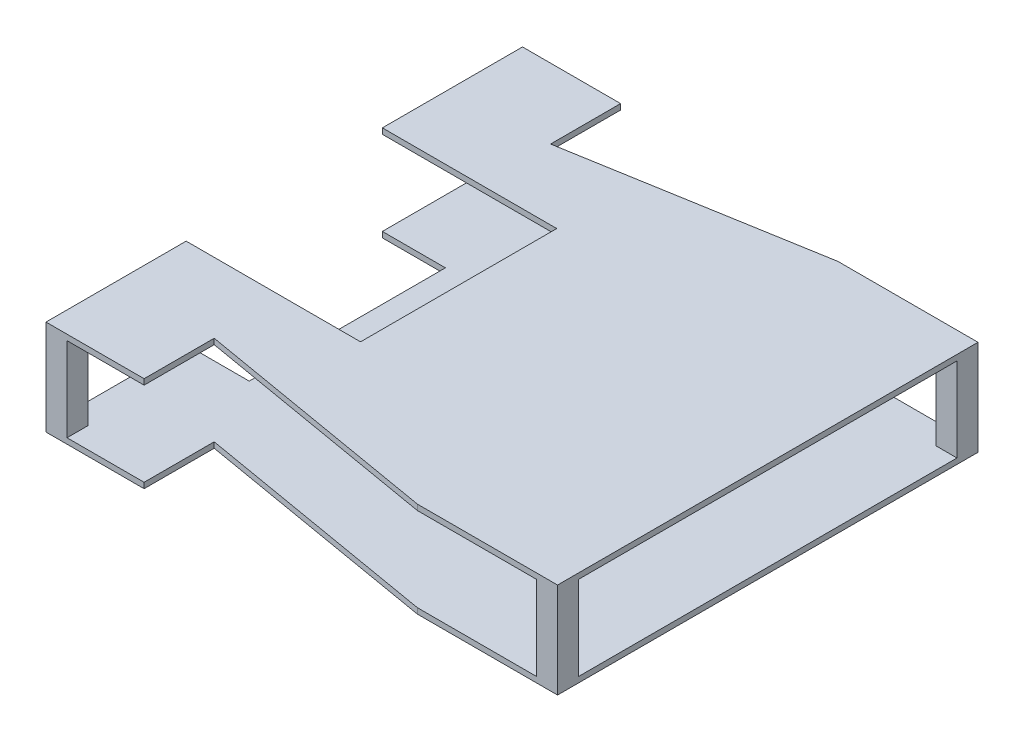
ISO-10303-21;
HEADER;
FILE_DESCRIPTION(('STEP AP214'),'2;1');
FILE_NAME('part.step','',(''),(''),'','','');
FILE_SCHEMA(('AUTOMOTIVE_DESIGN { 1 0 10303 214 1 1 1 1 }'));
ENDSEC;
DATA;
#1=APPLICATION_CONTEXT('core data for automotive mechanical design processes');
#2=APPLICATION_PROTOCOL_DEFINITION('international standard','automotive_design',2000,#1);
#3=PRODUCT_CONTEXT('',#1,'mechanical');
#4=PRODUCT('Part','Part','',(#3));
#5=PRODUCT_RELATED_PRODUCT_CATEGORY('part','',(#4));
#6=PRODUCT_DEFINITION_FORMATION('','',#4);
#7=PRODUCT_DEFINITION_CONTEXT('part definition',#1,'design');
#8=PRODUCT_DEFINITION('design','',#6,#7);
#9=PRODUCT_DEFINITION_SHAPE('','',#8);
#10=(LENGTH_UNIT() NAMED_UNIT(*) SI_UNIT(.MILLI.,.METRE.));
#11=(NAMED_UNIT(*) PLANE_ANGLE_UNIT() SI_UNIT($,.RADIAN.));
#12=(NAMED_UNIT(*) SI_UNIT($,.STERADIAN.) SOLID_ANGLE_UNIT());
#13=UNCERTAINTY_MEASURE_WITH_UNIT(LENGTH_MEASURE(1.E-05),#10,'distance_accuracy_value','');
#14=(GEOMETRIC_REPRESENTATION_CONTEXT(3) GLOBAL_UNCERTAINTY_ASSIGNED_CONTEXT((#13)) GLOBAL_UNIT_ASSIGNED_CONTEXT((#10,
#11,#12)) REPRESENTATION_CONTEXT('',''));
#15=CARTESIAN_POINT('',(0.,0.,0.));
#16=DIRECTION('',(0.,0.,1.));
#17=DIRECTION('',(1.,0.,0.));
#18=AXIS2_PLACEMENT_3D('',#15,#16,#17);
#19=CARTESIAN_POINT('',(0.,2.,0.));
#20=DIRECTION('',(0.,1.,0.));
#21=DIRECTION('',(0.,0.,1.));
#22=AXIS2_PLACEMENT_3D('',#19,#20,#21);
#23=PLANE('',#22);
#24=DIRECTION('',(-1.,0.,0.));
#25=VECTOR('',#24,1.);
#26=CARTESIAN_POINT('',(-22.4999999999999,2.,77.5));
#27=LINE('',#26,#25);
#28=CARTESIAN_POINT('',(-14.9999999999999,2.,77.5));
#29=VERTEX_POINT('',#28);
#30=CARTESIAN_POINT('',(-22.4999999999999,2.,77.5));
#31=VERTEX_POINT('',#30);
#32=EDGE_CURVE('E57',#29,#31,#27,.T.);
#33=ORIENTED_EDGE('',*,*,#32,.F.);
#34=DIRECTION('',(0.,0.,-1.));
#35=VECTOR('',#34,1.);
#36=CARTESIAN_POINT('',(-14.9999999999999,2.,85.));
#37=LINE('',#36,#35);
#38=CARTESIAN_POINT('',(-14.9999999999999,2.,85.));
#39=VERTEX_POINT('',#38);
#40=EDGE_CURVE('E433',#39,#29,#37,.T.);
#41=ORIENTED_EDGE('',*,*,#40,.F.);
#42=DIRECTION('',(1.,0.,0.));
#43=VECTOR('',#42,1.);
#44=CARTESIAN_POINT('',(0.,2.,85.));
#45=LINE('',#44,#43);
#46=CARTESIAN_POINT('',(12.5,2.,85.));
#47=VERTEX_POINT('',#46);
#48=EDGE_CURVE('E561',#39,#47,#45,.T.);
#49=ORIENTED_EDGE('',*,*,#48,.T.);
#50=DIRECTION('',(0.,0.,1.));
#51=VECTOR('',#50,1.);
#52=CARTESIAN_POINT('',(12.5,2.,0.));
#53=LINE('',#52,#51);
#54=CARTESIAN_POINT('',(12.5,2.,60.));
#55=VERTEX_POINT('',#54);
#56=EDGE_CURVE('E564',#55,#47,#53,.T.);
#57=ORIENTED_EDGE('',*,*,#56,.F.);
#58=DIRECTION('',(0.985622254813267,0.,0.168963815110845));
#59=VECTOR('',#58,1.);
#60=CARTESIAN_POINT('',(-9.63521015067404,2.,56.2053925455987));
#61=LINE('',#60,#59);
#62=CARTESIAN_POINT('',(100.,2.,75.));
#63=VERTEX_POINT('',#62);
#64=EDGE_CURVE('E568',#55,#63,#61,.T.);
#65=ORIENTED_EDGE('',*,*,#64,.T.);
#66=DIRECTION('',(1.,0.,0.));
#67=VECTOR('',#66,1.);
#68=CARTESIAN_POINT('',(0.,2.,75.));
#69=LINE('',#68,#67);
#70=CARTESIAN_POINT('',(142.5,2.,75.));
#71=VERTEX_POINT('',#70);
#72=EDGE_CURVE('E571',#63,#71,#69,.T.);
#73=ORIENTED_EDGE('',*,*,#72,.T.);
#74=DIRECTION('',(0.,0.,1.));
#75=VECTOR('',#74,1.);
#76=CARTESIAN_POINT('',(142.5,2.,75.));
#77=LINE('',#76,#75);
#78=CARTESIAN_POINT('',(142.5,2.,67.5));
#79=VERTEX_POINT('',#78);
#80=EDGE_CURVE('E492',#79,#71,#77,.T.);
#81=ORIENTED_EDGE('',*,*,#80,.F.);
#82=DIRECTION('',(-1.,0.,0.));
#83=VECTOR('',#82,1.);
#84=CARTESIAN_POINT('',(150.,2.,67.5));
#85=LINE('',#84,#83);
#86=CARTESIAN_POINT('',(150.,2.,67.5));
#87=VERTEX_POINT('',#86);
#88=EDGE_CURVE('E486',#87,#79,#85,.T.);
#89=ORIENTED_EDGE('',*,*,#88,.F.);
#90=DIRECTION('',(0.,0.,-1.));
#91=VECTOR('',#90,1.);
#92=CARTESIAN_POINT('',(150.,2.,0.));
#93=LINE('',#92,#91);
#94=CARTESIAN_POINT('',(150.,2.,-67.5));
#95=VERTEX_POINT('',#94);
#96=EDGE_CURVE('E574',#87,#95,#93,.T.);
#97=ORIENTED_EDGE('',*,*,#96,.T.);
#98=DIRECTION('',(1.,0.,0.));
#99=VECTOR('',#98,1.);
#100=CARTESIAN_POINT('',(150.,2.,-67.5));
#101=LINE('',#100,#99);
#102=CARTESIAN_POINT('',(142.5,2.,-67.5));
#103=VERTEX_POINT('',#102);
#104=EDGE_CURVE('E520',#103,#95,#101,.T.);
#105=ORIENTED_EDGE('',*,*,#104,.F.);
#106=DIRECTION('',(0.,0.,1.));
#107=VECTOR('',#106,1.);
#108=CARTESIAN_POINT('',(142.5,2.,-75.));
#109=LINE('',#108,#107);
#110=CARTESIAN_POINT('',(142.5,2.,-75.));
#111=VERTEX_POINT('',#110);
#112=EDGE_CURVE('E514',#111,#103,#109,.T.);
#113=ORIENTED_EDGE('',*,*,#112,.F.);
#114=DIRECTION('',(1.,0.,0.));
#115=VECTOR('',#114,1.);
#116=CARTESIAN_POINT('',(0.,2.,-75.));
#117=LINE('',#116,#115);
#118=CARTESIAN_POINT('',(100.180900234815,2.,-75.));
#119=VERTEX_POINT('',#118);
#120=EDGE_CURVE('E577',#119,#111,#117,.T.);
#121=ORIENTED_EDGE('',*,*,#120,.F.);
#122=DIRECTION('',(0.985622254813267,0.,-0.168963815110846));
#123=VECTOR('',#122,1.);
#124=CARTESIAN_POINT('',(-9.63004567132966,2.,-56.1752664160895));
#125=LINE('',#124,#123);
#126=CARTESIAN_POINT('',(12.6809002348147,2.,-60.));
#127=VERTEX_POINT('',#126);
#128=EDGE_CURVE('E581',#127,#119,#125,.T.);
#129=ORIENTED_EDGE('',*,*,#128,.F.);
#130=DIRECTION('',(1.,0.,0.));
#131=VECTOR('',#130,1.);
#132=CARTESIAN_POINT('',(0.,2.,-60.));
#133=LINE('',#132,#131);
#134=CARTESIAN_POINT('',(12.5,2.,-60.));
#135=VERTEX_POINT('',#134);
#136=EDGE_CURVE('E585',#135,#127,#133,.T.);
#137=ORIENTED_EDGE('',*,*,#136,.F.);
#138=DIRECTION('',(0.,0.,-1.));
#139=VECTOR('',#138,1.);
#140=CARTESIAN_POINT('',(12.5000000000001,2.,0.));
#141=LINE('',#140,#139);
#142=CARTESIAN_POINT('',(12.5,2.,-85.));
#143=VERTEX_POINT('',#142);
#144=EDGE_CURVE('E589',#135,#143,#141,.T.);
#145=ORIENTED_EDGE('',*,*,#144,.T.);
#146=DIRECTION('',(-1.,0.,0.));
#147=VECTOR('',#146,1.);
#148=CARTESIAN_POINT('',(0.,2.,-85.));
#149=LINE('',#148,#147);
#150=CARTESIAN_POINT('',(-15.,2.,-85.));
#151=VERTEX_POINT('',#150);
#152=EDGE_CURVE('E592',#143,#151,#149,.T.);
#153=ORIENTED_EDGE('',*,*,#152,.T.);
#154=DIRECTION('',(0.,0.,-1.));
#155=VECTOR('',#154,1.);
#156=CARTESIAN_POINT('',(-15.,2.,-85.));
#157=LINE('',#156,#155);
#158=CARTESIAN_POINT('',(-15.,2.,-77.5));
#159=VERTEX_POINT('',#158);
#160=EDGE_CURVE('E464',#159,#151,#157,.T.);
#161=ORIENTED_EDGE('',*,*,#160,.F.);
#162=DIRECTION('',(1.,0.,0.));
#163=VECTOR('',#162,1.);
#164=CARTESIAN_POINT('',(-22.5,2.,-77.5));
#165=LINE('',#164,#163);
#166=CARTESIAN_POINT('',(-22.5,2.,-77.5));
#167=VERTEX_POINT('',#166);
#168=EDGE_CURVE('E458',#167,#159,#165,.T.);
#169=ORIENTED_EDGE('',*,*,#168,.F.);
#170=DIRECTION('',(0.,0.,-1.));
#171=VECTOR('',#170,1.);
#172=CARTESIAN_POINT('',(-22.5,2.,0.));
#173=LINE('',#172,#171);
#174=CARTESIAN_POINT('',(-22.5,2.,-35.));
#175=VERTEX_POINT('',#174);
#176=EDGE_CURVE('E543',#175,#167,#173,.T.);
#177=ORIENTED_EDGE('',*,*,#176,.F.);
#178=DIRECTION('',(-1.,0.,0.));
#179=VECTOR('',#178,1.);
#180=CARTESIAN_POINT('',(0.,2.,-35.));
#181=LINE('',#180,#179);
#182=CARTESIAN_POINT('',(0.,2.,-35.));
#183=VERTEX_POINT('',#182);
#184=EDGE_CURVE('E547',#183,#175,#181,.T.);
#185=ORIENTED_EDGE('',*,*,#184,.F.);
#186=DIRECTION('',(0.,0.,1.));
#187=VECTOR('',#186,1.);
#188=CARTESIAN_POINT('',(0.,2.,0.));
#189=LINE('',#188,#187);
#190=CARTESIAN_POINT('',(0.,2.,35.));
#191=VERTEX_POINT('',#190);
#192=EDGE_CURVE('E552',#183,#191,#189,.T.);
#193=ORIENTED_EDGE('',*,*,#192,.T.);
#194=DIRECTION('',(1.,0.,0.));
#195=VECTOR('',#194,1.);
#196=CARTESIAN_POINT('',(0.,2.,35.));
#197=LINE('',#196,#195);
#198=CARTESIAN_POINT('',(-22.5,2.,35.));
#199=VERTEX_POINT('',#198);
#200=EDGE_CURVE('E555',#199,#191,#197,.T.);
#201=ORIENTED_EDGE('',*,*,#200,.F.);
#202=DIRECTION('',(0.,0.,1.));
#203=VECTOR('',#202,1.);
#204=CARTESIAN_POINT('',(-22.5,2.,0.));
#205=LINE('',#204,#203);
#206=EDGE_CURVE('E62',#199,#31,#205,.T.);
#207=ORIENTED_EDGE('',*,*,#206,.T.);
#208=EDGE_LOOP('',(#33,#41,#49,#57,#65,#73,#81,#89,#97,#105,#113,#121,#129,#137,#145,#153,#161,
#169,#177,#185,#193,#201,#207));
#209=FACE_BOUND('',#208,.T.);
#210=ADVANCED_FACE('F41',(#209),#23,.T.);
#211=CARTESIAN_POINT('',(-22.5,2.,0.));
#212=DIRECTION('',(-1.,0.,0.));
#213=DIRECTION('',(0.,0.,1.));
#214=AXIS2_PLACEMENT_3D('',#211,#212,#213);
#215=PLANE('',#214);
#216=DIRECTION('',(0.,0.,-1.));
#217=VECTOR('',#216,1.);
#218=CARTESIAN_POINT('',(-22.5,0.,0.));
#219=LINE('',#218,#217);
#220=CARTESIAN_POINT('',(-22.5,0.,-35.));
#221=VERTEX_POINT('',#220);
#222=CARTESIAN_POINT('',(-22.5,0.,-85.));
#223=VERTEX_POINT('',#222);
#224=EDGE_CURVE('E542',#221,#223,#219,.T.);
#225=ORIENTED_EDGE('',*,*,#224,.F.);
#226=DIRECTION('',(0.,-1.,0.));
#227=VECTOR('',#226,1.);
#228=CARTESIAN_POINT('',(-22.5,2.,-35.));
#229=LINE('',#228,#227);
#230=EDGE_CURVE('E11',#175,#221,#229,.T.);
#231=ORIENTED_EDGE('',*,*,#230,.F.);
#232=ORIENTED_EDGE('',*,*,#176,.T.);
#233=DIRECTION('',(0.,-1.,0.));
#234=VECTOR('',#233,1.);
#235=CARTESIAN_POINT('',(-22.5,32.,-77.5));
#236=LINE('',#235,#234);
#237=CARTESIAN_POINT('',(-22.5,32.,-77.5));
#238=VERTEX_POINT('',#237);
#239=EDGE_CURVE('E482',#238,#167,#236,.T.);
#240=ORIENTED_EDGE('',*,*,#239,.F.);
#241=DIRECTION('',(0.,0.,1.));
#242=VECTOR('',#241,1.);
#243=CARTESIAN_POINT('',(-22.5,32.,-65.));
#244=LINE('',#243,#242);
#245=CARTESIAN_POINT('',(-22.5,32.,-35.));
#246=VERTEX_POINT('',#245);
#247=EDGE_CURVE('E372',#238,#246,#244,.T.);
#248=ORIENTED_EDGE('',*,*,#247,.T.);
#249=DIRECTION('',(0.,-1.,0.));
#250=VECTOR('',#249,1.);
#251=CARTESIAN_POINT('',(-22.5,34.,-35.));
#252=LINE('',#251,#250);
#253=CARTESIAN_POINT('',(-22.5,34.,-35.));
#254=VERTEX_POINT('',#253);
#255=EDGE_CURVE('E419',#254,#246,#252,.T.);
#256=ORIENTED_EDGE('',*,*,#255,.F.);
#257=DIRECTION('',(0.,0.,1.));
#258=VECTOR('',#257,1.);
#259=CARTESIAN_POINT('',(-22.5,34.,-65.));
#260=LINE('',#259,#258);
#261=CARTESIAN_POINT('',(-22.5,34.,-85.));
#262=VERTEX_POINT('',#261);
#263=EDGE_CURVE('E327',#262,#254,#260,.T.);
#264=ORIENTED_EDGE('',*,*,#263,.F.);
#265=DIRECTION('',(0.,-1.,0.));
#266=VECTOR('',#265,1.);
#267=CARTESIAN_POINT('',(-22.5,2.,-85.));
#268=LINE('',#267,#266);
#269=EDGE_CURVE('E595',#262,#223,#268,.T.);
#270=ORIENTED_EDGE('',*,*,#269,.T.);
#271=EDGE_LOOP('',(#225,#231,#232,#240,#248,#256,#264,#270));
#272=FACE_BOUND('',#271,.T.);
#273=ADVANCED_FACE('F43',(#272),#215,.T.);
#274=CARTESIAN_POINT('',(0.,2.,-35.));
#275=DIRECTION('',(0.,0.,1.));
#276=DIRECTION('',(1.,0.,0.));
#277=AXIS2_PLACEMENT_3D('',#274,#275,#276);
#278=PLANE('',#277);
#279=DIRECTION('',(-1.,0.,0.));
#280=VECTOR('',#279,1.);
#281=CARTESIAN_POINT('',(0.,0.,-35.));
#282=LINE('',#281,#280);
#283=CARTESIAN_POINT('',(0.,0.,-35.));
#284=VERTEX_POINT('',#283);
#285=EDGE_CURVE('E599',#284,#221,#282,.T.);
#286=ORIENTED_EDGE('',*,*,#285,.F.);
#287=DIRECTION('',(0.,-1.,0.));
#288=VECTOR('',#287,1.);
#289=CARTESIAN_POINT('',(0.,2.,-35.));
#290=LINE('',#289,#288);
#291=EDGE_CURVE('E50',#183,#284,#290,.T.);
#292=ORIENTED_EDGE('',*,*,#291,.F.);
#293=ORIENTED_EDGE('',*,*,#184,.T.);
#294=ORIENTED_EDGE('',*,*,#230,.T.);
#295=EDGE_LOOP('',(#286,#292,#293,#294));
#296=FACE_BOUND('',#295,.T.);
#297=ADVANCED_FACE('F695',(#296),#278,.T.);
#298=CARTESIAN_POINT('',(0.,2.,0.));
#299=DIRECTION('',(1.,0.,0.));
#300=DIRECTION('',(0.,0.,-1.));
#301=AXIS2_PLACEMENT_3D('',#298,#299,#300);
#302=PLANE('',#301);
#303=DIRECTION('',(0.,0.,1.));
#304=VECTOR('',#303,1.);
#305=CARTESIAN_POINT('',(0.,0.,0.));
#306=LINE('',#305,#304);
#307=CARTESIAN_POINT('',(0.,0.,35.));
#308=VERTEX_POINT('',#307);
#309=EDGE_CURVE('E603',#284,#308,#306,.T.);
#310=ORIENTED_EDGE('',*,*,#309,.T.);
#311=DIRECTION('',(0.,-1.,0.));
#312=VECTOR('',#311,1.);
#313=CARTESIAN_POINT('',(0.,2.,35.));
#314=LINE('',#313,#312);
#315=EDGE_CURVE('E680',#191,#308,#314,.T.);
#316=ORIENTED_EDGE('',*,*,#315,.F.);
#317=ORIENTED_EDGE('',*,*,#192,.F.);
#318=ORIENTED_EDGE('',*,*,#291,.T.);
#319=EDGE_LOOP('',(#310,#316,#317,#318));
#320=FACE_BOUND('',#319,.T.);
#321=ADVANCED_FACE('F686',(#320),#302,.F.);
#322=CARTESIAN_POINT('',(0.,2.,35.));
#323=DIRECTION('',(0.,0.,-1.));
#324=DIRECTION('',(-1.,0.,0.));
#325=AXIS2_PLACEMENT_3D('',#322,#323,#324);
#326=PLANE('',#325);
#327=DIRECTION('',(1.,0.,0.));
#328=VECTOR('',#327,1.);
#329=CARTESIAN_POINT('',(0.,0.,35.));
#330=LINE('',#329,#328);
#331=CARTESIAN_POINT('',(-22.5,0.,35.));
#332=VERTEX_POINT('',#331);
#333=EDGE_CURVE('E607',#332,#308,#330,.T.);
#334=ORIENTED_EDGE('',*,*,#333,.F.);
#335=DIRECTION('',(0.,-1.,0.));
#336=VECTOR('',#335,1.);
#337=CARTESIAN_POINT('',(-22.5,2.,35.));
#338=LINE('',#337,#336);
#339=EDGE_CURVE('E677',#199,#332,#338,.T.);
#340=ORIENTED_EDGE('',*,*,#339,.F.);
#341=ORIENTED_EDGE('',*,*,#200,.T.);
#342=ORIENTED_EDGE('',*,*,#315,.T.);
#343=EDGE_LOOP('',(#334,#340,#341,#342));
#344=FACE_BOUND('',#343,.T.);
#345=ADVANCED_FACE('F791',(#344),#326,.T.);
#346=CARTESIAN_POINT('',(-22.5,2.,0.));
#347=DIRECTION('',(1.,0.,0.));
#348=DIRECTION('',(0.,0.,-1.));
#349=AXIS2_PLACEMENT_3D('',#346,#347,#348);
#350=PLANE('',#349);
#351=DIRECTION('',(0.,0.,1.));
#352=VECTOR('',#351,1.);
#353=CARTESIAN_POINT('',(-22.5,0.,0.));
#354=LINE('',#353,#352);
#355=CARTESIAN_POINT('',(-22.4999999999999,0.,85.));
#356=VERTEX_POINT('',#355);
#357=EDGE_CURVE('E611',#332,#356,#354,.T.);
#358=ORIENTED_EDGE('',*,*,#357,.T.);
#359=DIRECTION('',(0.,-1.,0.));
#360=VECTOR('',#359,1.);
#361=CARTESIAN_POINT('',(-22.4999999999999,2.,85.));
#362=LINE('',#361,#360);
#363=CARTESIAN_POINT('',(-22.4999999999999,34.,85.));
#364=VERTEX_POINT('',#363);
#365=EDGE_CURVE('E673',#364,#356,#362,.T.);
#366=ORIENTED_EDGE('',*,*,#365,.F.);
#367=DIRECTION('',(0.,0.,1.));
#368=VECTOR('',#367,1.);
#369=CARTESIAN_POINT('',(-22.5,34.,35.));
#370=LINE('',#369,#368);
#371=CARTESIAN_POINT('',(-22.5,34.,35.));
#372=VERTEX_POINT('',#371);
#373=EDGE_CURVE('E339',#372,#364,#370,.T.);
#374=ORIENTED_EDGE('',*,*,#373,.F.);
#375=DIRECTION('',(0.,-1.,0.));
#376=VECTOR('',#375,1.);
#377=CARTESIAN_POINT('',(-22.5,34.,35.));
#378=LINE('',#377,#376);
#379=CARTESIAN_POINT('',(-22.5,32.,35.));
#380=VERTEX_POINT('',#379);
#381=EDGE_CURVE('E407',#372,#380,#378,.T.);
#382=ORIENTED_EDGE('',*,*,#381,.T.);
#383=DIRECTION('',(0.,0.,1.));
#384=VECTOR('',#383,1.);
#385=CARTESIAN_POINT('',(-22.5,32.,35.));
#386=LINE('',#385,#384);
#387=CARTESIAN_POINT('',(-22.4999999999999,32.,77.5));
#388=VERTEX_POINT('',#387);
#389=EDGE_CURVE('E384',#380,#388,#386,.T.);
#390=ORIENTED_EDGE('',*,*,#389,.T.);
#391=DIRECTION('',(0.,-1.,0.));
#392=VECTOR('',#391,1.);
#393=CARTESIAN_POINT('',(-22.4999999999999,32.,77.5));
#394=LINE('',#393,#392);
#395=EDGE_CURVE('E442',#388,#31,#394,.T.);
#396=ORIENTED_EDGE('',*,*,#395,.T.);
#397=ORIENTED_EDGE('',*,*,#206,.F.);
#398=ORIENTED_EDGE('',*,*,#339,.T.);
#399=EDGE_LOOP('',(#358,#366,#374,#382,#390,#396,#397,#398));
#400=FACE_BOUND('',#399,.T.);
#401=ADVANCED_FACE('F760',(#400),#350,.F.);
#402=CARTESIAN_POINT('',(0.,2.,85.));
#403=DIRECTION('',(0.,0.,-1.));
#404=DIRECTION('',(-1.,0.,0.));
#405=AXIS2_PLACEMENT_3D('',#402,#403,#404);
#406=PLANE('',#405);
#407=DIRECTION('',(1.,0.,0.));
#408=VECTOR('',#407,1.);
#409=CARTESIAN_POINT('',(0.,0.,85.));
#410=LINE('',#409,#408);
#411=CARTESIAN_POINT('',(12.5,0.,85.));
#412=VERTEX_POINT('',#411);
#413=EDGE_CURVE('E614',#356,#412,#410,.T.);
#414=ORIENTED_EDGE('',*,*,#413,.T.);
#415=DIRECTION('',(0.,-1.,0.));
#416=VECTOR('',#415,1.);
#417=CARTESIAN_POINT('',(12.5,2.,85.));
#418=LINE('',#417,#416);
#419=EDGE_CURVE('E670',#47,#412,#418,.T.);
#420=ORIENTED_EDGE('',*,*,#419,.F.);
#421=ORIENTED_EDGE('',*,*,#48,.F.);
#422=DIRECTION('',(0.,-1.,0.));
#423=VECTOR('',#422,1.);
#424=CARTESIAN_POINT('',(-14.9999999999999,32.,85.));
#425=LINE('',#424,#423);
#426=CARTESIAN_POINT('',(-14.9999999999999,32.,85.));
#427=VERTEX_POINT('',#426);
#428=EDGE_CURVE('E454',#427,#39,#425,.T.);
#429=ORIENTED_EDGE('',*,*,#428,.F.);
#430=DIRECTION('',(1.,0.,0.));
#431=VECTOR('',#430,1.);
#432=CARTESIAN_POINT('',(-22.4999999999999,32.,85.));
#433=LINE('',#432,#431);
#434=CARTESIAN_POINT('',(12.5,32.,85.));
#435=VERTEX_POINT('',#434);
#436=EDGE_CURVE('E388',#427,#435,#433,.T.);
#437=ORIENTED_EDGE('',*,*,#436,.T.);
#438=DIRECTION('',(0.,-1.,0.));
#439=VECTOR('',#438,1.);
#440=CARTESIAN_POINT('',(12.5,34.,85.));
#441=LINE('',#440,#439);
#442=CARTESIAN_POINT('',(12.5,34.,85.));
#443=VERTEX_POINT('',#442);
#444=EDGE_CURVE('E403',#443,#435,#441,.T.);
#445=ORIENTED_EDGE('',*,*,#444,.F.);
#446=DIRECTION('',(1.,0.,0.));
#447=VECTOR('',#446,1.);
#448=CARTESIAN_POINT('',(-22.4999999999999,34.,85.));
#449=LINE('',#448,#447);
#450=EDGE_CURVE('E343',#364,#443,#449,.T.);
#451=ORIENTED_EDGE('',*,*,#450,.F.);
#452=ORIENTED_EDGE('',*,*,#365,.T.);
#453=EDGE_LOOP('',(#414,#420,#421,#429,#437,#445,#451,#452));
#454=FACE_BOUND('',#453,.T.);
#455=ADVANCED_FACE('F764',(#454),#406,.F.);
#456=CARTESIAN_POINT('',(12.5,2.,0.));
#457=DIRECTION('',(1.,0.,0.));
#458=DIRECTION('',(0.,0.,-1.));
#459=AXIS2_PLACEMENT_3D('',#456,#457,#458);
#460=PLANE('',#459);
#461=DIRECTION('',(0.,0.,1.));
#462=VECTOR('',#461,1.);
#463=CARTESIAN_POINT('',(12.5,0.,0.));
#464=LINE('',#463,#462);
#465=CARTESIAN_POINT('',(12.5,0.,60.));
#466=VERTEX_POINT('',#465);
#467=EDGE_CURVE('E618',#466,#412,#464,.T.);
#468=ORIENTED_EDGE('',*,*,#467,.F.);
#469=DIRECTION('',(0.,-1.,0.));
#470=VECTOR('',#469,1.);
#471=CARTESIAN_POINT('',(12.5,2.,60.));
#472=LINE('',#471,#470);
#473=EDGE_CURVE('E667',#55,#466,#472,.T.);
#474=ORIENTED_EDGE('',*,*,#473,.F.);
#475=ORIENTED_EDGE('',*,*,#56,.T.);
#476=ORIENTED_EDGE('',*,*,#419,.T.);
#477=EDGE_LOOP('',(#468,#474,#475,#476));
#478=FACE_BOUND('',#477,.T.);
#479=ADVANCED_FACE('F786',(#478),#460,.T.);
#480=CARTESIAN_POINT('',(-9.63521015067404,2.,56.2053925455987));
#481=DIRECTION('',(0.168963815110845,0.,-0.985622254813267));
#482=DIRECTION('',(-0.985622254813267,0.,-0.168963815110845));
#483=AXIS2_PLACEMENT_3D('',#480,#481,#482);
#484=PLANE('',#483);
#485=DIRECTION('',(0.985622254813267,0.,0.168963815110845));
#486=VECTOR('',#485,1.);
#487=CARTESIAN_POINT('',(-9.63521015067404,0.,56.2053925455987));
#488=LINE('',#487,#486);
#489=CARTESIAN_POINT('',(100.,0.,75.));
#490=VERTEX_POINT('',#489);
#491=EDGE_CURVE('E622',#466,#490,#488,.T.);
#492=ORIENTED_EDGE('',*,*,#491,.T.);
#493=DIRECTION('',(0.,-1.,0.));
#494=VECTOR('',#493,1.);
#495=CARTESIAN_POINT('',(100.,2.,75.));
#496=LINE('',#495,#494);
#497=EDGE_CURVE('E663',#63,#490,#496,.T.);
#498=ORIENTED_EDGE('',*,*,#497,.F.);
#499=ORIENTED_EDGE('',*,*,#64,.F.);
#500=ORIENTED_EDGE('',*,*,#473,.T.);
#501=EDGE_LOOP('',(#492,#498,#499,#500));
#502=FACE_BOUND('',#501,.T.);
#503=ADVANCED_FACE('F802',(#502),#484,.F.);
#504=CARTESIAN_POINT('',(0.,2.,75.));
#505=DIRECTION('',(0.,0.,-1.));
#506=DIRECTION('',(-1.,0.,0.));
#507=AXIS2_PLACEMENT_3D('',#504,#505,#506);
#508=PLANE('',#507);
#509=DIRECTION('',(1.,0.,0.));
#510=VECTOR('',#509,1.);
#511=CARTESIAN_POINT('',(0.,0.,75.));
#512=LINE('',#511,#510);
#513=CARTESIAN_POINT('',(150.,0.,75.));
#514=VERTEX_POINT('',#513);
#515=EDGE_CURVE('E625',#490,#514,#512,.T.);
#516=ORIENTED_EDGE('',*,*,#515,.T.);
#517=DIRECTION('',(0.,-1.,0.));
#518=VECTOR('',#517,1.);
#519=CARTESIAN_POINT('',(150.,2.,75.));
#520=LINE('',#519,#518);
#521=CARTESIAN_POINT('',(150.,34.,75.));
#522=VERTEX_POINT('',#521);
#523=EDGE_CURVE('E293',#522,#514,#520,.T.);
#524=ORIENTED_EDGE('',*,*,#523,.F.);
#525=DIRECTION('',(1.,0.,0.));
#526=VECTOR('',#525,1.);
#527=CARTESIAN_POINT('',(100.,34.,75.));
#528=LINE('',#527,#526);
#529=CARTESIAN_POINT('',(100.,34.,75.));
#530=VERTEX_POINT('',#529);
#531=EDGE_CURVE('E309',#530,#522,#528,.T.);
#532=ORIENTED_EDGE('',*,*,#531,.F.);
#533=DIRECTION('',(0.,-1.,0.));
#534=VECTOR('',#533,1.);
#535=CARTESIAN_POINT('',(100.,34.,75.));
#536=LINE('',#535,#534);
#537=CARTESIAN_POINT('',(100.,32.,75.));
#538=VERTEX_POINT('',#537);
#539=EDGE_CURVE('E354',#530,#538,#536,.T.);
#540=ORIENTED_EDGE('',*,*,#539,.T.);
#541=DIRECTION('',(1.,0.,0.));
#542=VECTOR('',#541,1.);
#543=CARTESIAN_POINT('',(100.,32.,75.));
#544=LINE('',#543,#542);
#545=CARTESIAN_POINT('',(142.5,32.,75.));
#546=VERTEX_POINT('',#545);
#547=EDGE_CURVE('E311',#538,#546,#544,.T.);
#548=ORIENTED_EDGE('',*,*,#547,.T.);
#549=DIRECTION('',(0.,-1.,0.));
#550=VECTOR('',#549,1.);
#551=CARTESIAN_POINT('',(142.5,32.,75.));
#552=LINE('',#551,#550);
#553=EDGE_CURVE('E496',#546,#71,#552,.T.);
#554=ORIENTED_EDGE('',*,*,#553,.T.);
#555=ORIENTED_EDGE('',*,*,#72,.F.);
#556=ORIENTED_EDGE('',*,*,#497,.T.);
#557=EDGE_LOOP('',(#516,#524,#532,#540,#548,#554,#555,#556));
#558=FACE_BOUND('',#557,.T.);
#559=ADVANCED_FACE('F779',(#558),#508,.F.);
#560=CARTESIAN_POINT('',(150.,2.,0.));
#561=DIRECTION('',(-1.,0.,0.));
#562=DIRECTION('',(0.,0.,1.));
#563=AXIS2_PLACEMENT_3D('',#560,#561,#562);
#564=PLANE('',#563);
#565=DIRECTION('',(0.,-1.,0.));
#566=VECTOR('',#565,1.);
#567=CARTESIAN_POINT('',(150.,2.,-75.));
#568=LINE('',#567,#566);
#569=CARTESIAN_POINT('',(150.,34.,-75.));
#570=VERTEX_POINT('',#569);
#571=CARTESIAN_POINT('',(150.,0.,-75.));
#572=VERTEX_POINT('',#571);
#573=EDGE_CURVE('E280',#570,#572,#568,.T.);
#574=ORIENTED_EDGE('',*,*,#573,.F.);
#575=DIRECTION('',(0.,0.,-1.));
#576=VECTOR('',#575,1.);
#577=CARTESIAN_POINT('',(150.,34.,75.));
#578=LINE('',#577,#576);
#579=EDGE_CURVE('E286',#522,#570,#578,.T.);
#580=ORIENTED_EDGE('',*,*,#579,.F.);
#581=ORIENTED_EDGE('',*,*,#523,.T.);
#582=DIRECTION('',(0.,0.,-1.));
#583=VECTOR('',#582,1.);
#584=CARTESIAN_POINT('',(150.,0.,0.));
#585=LINE('',#584,#583);
#586=EDGE_CURVE('E288',#514,#572,#585,.T.);
#587=ORIENTED_EDGE('',*,*,#586,.T.);
#588=EDGE_LOOP('',(#574,#580,#581,#587));
#589=FACE_BOUND('',#588,.T.);
#590=DIRECTION('',(0.,0.,-1.));
#591=VECTOR('',#590,1.);
#592=CARTESIAN_POINT('',(150.,32.,75.));
#593=LINE('',#592,#591);
#594=CARTESIAN_POINT('',(150.,32.,67.5));
#595=VERTEX_POINT('',#594);
#596=CARTESIAN_POINT('',(150.,32.,-67.5));
#597=VERTEX_POINT('',#596);
#598=EDGE_CURVE('E355',#595,#597,#593,.T.);
#599=ORIENTED_EDGE('',*,*,#598,.T.);
#600=DIRECTION('',(0.,-1.,0.));
#601=VECTOR('',#600,1.);
#602=CARTESIAN_POINT('',(150.,32.,-67.5));
#603=LINE('',#602,#601);
#604=EDGE_CURVE('E524',#597,#95,#603,.T.);
#605=ORIENTED_EDGE('',*,*,#604,.T.);
#606=ORIENTED_EDGE('',*,*,#96,.F.);
#607=DIRECTION('',(0.,-1.,0.));
#608=VECTOR('',#607,1.);
#609=CARTESIAN_POINT('',(150.,32.,67.5));
#610=LINE('',#609,#608);
#611=EDGE_CURVE('E510',#595,#87,#610,.T.);
#612=ORIENTED_EDGE('',*,*,#611,.F.);
#613=EDGE_LOOP('',(#599,#605,#606,#612));
#614=FACE_BOUND('',#613,.T.);
#615=ADVANCED_FACE('F282',(#589,#614),#564,.F.);
#616=CARTESIAN_POINT('',(0.,2.,-75.));
#617=DIRECTION('',(0.,0.,-1.));
#618=DIRECTION('',(-1.,0.,0.));
#619=AXIS2_PLACEMENT_3D('',#616,#617,#618);
#620=PLANE('',#619);
#621=DIRECTION('',(1.,0.,0.));
#622=VECTOR('',#621,1.);
#623=CARTESIAN_POINT('',(0.,0.,-75.));
#624=LINE('',#623,#622);
#625=CARTESIAN_POINT('',(100.180900234815,0.,-75.));
#626=VERTEX_POINT('',#625);
#627=EDGE_CURVE('E630',#626,#572,#624,.T.);
#628=ORIENTED_EDGE('',*,*,#627,.F.);
#629=DIRECTION('',(0.,-1.,0.));
#630=VECTOR('',#629,1.);
#631=CARTESIAN_POINT('',(100.180900234815,2.,-75.));
#632=LINE('',#631,#630);
#633=EDGE_CURVE('E294',#119,#626,#632,.T.);
#634=ORIENTED_EDGE('',*,*,#633,.F.);
#635=ORIENTED_EDGE('',*,*,#120,.T.);
#636=DIRECTION('',(0.,-1.,0.));
#637=VECTOR('',#636,1.);
#638=CARTESIAN_POINT('',(142.5,32.,-75.));
#639=LINE('',#638,#637);
#640=CARTESIAN_POINT('',(142.5,32.,-75.));
#641=VERTEX_POINT('',#640);
#642=EDGE_CURVE('E538',#641,#111,#639,.T.);
#643=ORIENTED_EDGE('',*,*,#642,.F.);
#644=DIRECTION('',(-1.,0.,0.));
#645=VECTOR('',#644,1.);
#646=CARTESIAN_POINT('',(150.,32.,-75.));
#647=LINE('',#646,#645);
#648=CARTESIAN_POINT('',(100.,32.,-75.));
#649=VERTEX_POINT('',#648);
#650=EDGE_CURVE('E359',#641,#649,#647,.T.);
#651=ORIENTED_EDGE('',*,*,#650,.T.);
#652=DIRECTION('',(0.,-1.,0.));
#653=VECTOR('',#652,1.);
#654=CARTESIAN_POINT('',(100.,34.,-75.));
#655=LINE('',#654,#653);
#656=CARTESIAN_POINT('',(100.,34.,-75.));
#657=VERTEX_POINT('',#656);
#658=EDGE_CURVE('E300',#657,#649,#655,.T.);
#659=ORIENTED_EDGE('',*,*,#658,.F.);
#660=DIRECTION('',(-1.,0.,0.));
#661=VECTOR('',#660,1.);
#662=CARTESIAN_POINT('',(150.,34.,-75.));
#663=LINE('',#662,#661);
#664=EDGE_CURVE('E297',#570,#657,#663,.T.);
#665=ORIENTED_EDGE('',*,*,#664,.F.);
#666=ORIENTED_EDGE('',*,*,#573,.T.);
#667=EDGE_LOOP('',(#628,#634,#635,#643,#651,#659,#665,#666));
#668=FACE_BOUND('',#667,.T.);
#669=ADVANCED_FACE('F298',(#668),#620,.T.);
#670=CARTESIAN_POINT('',(-9.63004567132966,2.,-56.1752664160895));
#671=DIRECTION('',(-0.168963815110846,0.,-0.985622254813267));
#672=DIRECTION('',(-0.985622254813267,0.,0.168963815110846));
#673=AXIS2_PLACEMENT_3D('',#670,#671,#672);
#674=PLANE('',#673);
#675=DIRECTION('',(0.985622254813267,0.,-0.168963815110846));
#676=VECTOR('',#675,1.);
#677=CARTESIAN_POINT('',(-9.63004567132966,0.,-56.1752664160895));
#678=LINE('',#677,#676);
#679=CARTESIAN_POINT('',(12.6809002348147,0.,-60.));
#680=VERTEX_POINT('',#679);
#681=EDGE_CURVE('E633',#680,#626,#678,.T.);
#682=ORIENTED_EDGE('',*,*,#681,.F.);
#683=DIRECTION('',(0.,-1.,0.));
#684=VECTOR('',#683,1.);
#685=CARTESIAN_POINT('',(12.6809002348147,2.,-60.));
#686=LINE('',#685,#684);
#687=EDGE_CURVE('E656',#127,#680,#686,.T.);
#688=ORIENTED_EDGE('',*,*,#687,.F.);
#689=ORIENTED_EDGE('',*,*,#128,.T.);
#690=ORIENTED_EDGE('',*,*,#633,.T.);
#691=EDGE_LOOP('',(#682,#688,#689,#690));
#692=FACE_BOUND('',#691,.T.);
#693=ADVANCED_FACE('F716',(#692),#674,.T.);
#694=CARTESIAN_POINT('',(0.,2.,-60.));
#695=DIRECTION('',(0.,0.,-1.));
#696=DIRECTION('',(-1.,0.,0.));
#697=AXIS2_PLACEMENT_3D('',#694,#695,#696);
#698=PLANE('',#697);
#699=DIRECTION('',(1.,0.,0.));
#700=VECTOR('',#699,1.);
#701=CARTESIAN_POINT('',(0.,0.,-60.));
#702=LINE('',#701,#700);
#703=CARTESIAN_POINT('',(12.5,0.,-60.));
#704=VERTEX_POINT('',#703);
#705=EDGE_CURVE('E637',#704,#680,#702,.T.);
#706=ORIENTED_EDGE('',*,*,#705,.F.);
#707=DIRECTION('',(0.,-1.,0.));
#708=VECTOR('',#707,1.);
#709=CARTESIAN_POINT('',(12.5,2.,-60.));
#710=LINE('',#709,#708);
#711=EDGE_CURVE('E653',#135,#704,#710,.T.);
#712=ORIENTED_EDGE('',*,*,#711,.F.);
#713=ORIENTED_EDGE('',*,*,#136,.T.);
#714=ORIENTED_EDGE('',*,*,#687,.T.);
#715=EDGE_LOOP('',(#706,#712,#713,#714));
#716=FACE_BOUND('',#715,.T.);
#717=ADVANCED_FACE('F713',(#716),#698,.T.);
#718=CARTESIAN_POINT('',(12.5000000000001,2.,0.));
#719=DIRECTION('',(-1.,0.,0.));
#720=DIRECTION('',(0.,0.,1.));
#721=AXIS2_PLACEMENT_3D('',#718,#719,#720);
#722=PLANE('',#721);
#723=DIRECTION('',(0.,0.,-1.));
#724=VECTOR('',#723,1.);
#725=CARTESIAN_POINT('',(12.5000000000001,0.,0.));
#726=LINE('',#725,#724);
#727=CARTESIAN_POINT('',(12.5,0.,-85.));
#728=VERTEX_POINT('',#727);
#729=EDGE_CURVE('E641',#704,#728,#726,.T.);
#730=ORIENTED_EDGE('',*,*,#729,.T.);
#731=DIRECTION('',(0.,-1.,0.));
#732=VECTOR('',#731,1.);
#733=CARTESIAN_POINT('',(12.5,2.,-85.));
#734=LINE('',#733,#732);
#735=EDGE_CURVE('E649',#143,#728,#734,.T.);
#736=ORIENTED_EDGE('',*,*,#735,.F.);
#737=ORIENTED_EDGE('',*,*,#144,.F.);
#738=ORIENTED_EDGE('',*,*,#711,.T.);
#739=EDGE_LOOP('',(#730,#736,#737,#738));
#740=FACE_BOUND('',#739,.T.);
#741=ADVANCED_FACE('F710',(#740),#722,.F.);
#742=CARTESIAN_POINT('',(0.,2.,-85.));
#743=DIRECTION('',(0.,0.,1.));
#744=DIRECTION('',(1.,0.,0.));
#745=AXIS2_PLACEMENT_3D('',#742,#743,#744);
#746=PLANE('',#745);
#747=DIRECTION('',(-1.,0.,0.));
#748=VECTOR('',#747,1.);
#749=CARTESIAN_POINT('',(0.,0.,-85.));
#750=LINE('',#749,#748);
#751=EDGE_CURVE('E548',#728,#223,#750,.T.);
#752=ORIENTED_EDGE('',*,*,#751,.T.);
#753=ORIENTED_EDGE('',*,*,#269,.F.);
#754=DIRECTION('',(-1.,0.,0.));
#755=VECTOR('',#754,1.);
#756=CARTESIAN_POINT('',(-22.5,34.,-85.));
#757=LINE('',#756,#755);
#758=CARTESIAN_POINT('',(12.5,34.,-85.));
#759=VERTEX_POINT('',#758);
#760=EDGE_CURVE('E323',#759,#262,#757,.T.);
#761=ORIENTED_EDGE('',*,*,#760,.F.);
#762=DIRECTION('',(0.,-1.,0.));
#763=VECTOR('',#762,1.);
#764=CARTESIAN_POINT('',(12.5,34.,-85.));
#765=LINE('',#764,#763);
#766=CARTESIAN_POINT('',(12.5,32.,-85.));
#767=VERTEX_POINT('',#766);
#768=EDGE_CURVE('E423',#759,#767,#765,.T.);
#769=ORIENTED_EDGE('',*,*,#768,.T.);
#770=DIRECTION('',(-1.,0.,0.));
#771=VECTOR('',#770,1.);
#772=CARTESIAN_POINT('',(-22.5,32.,-85.));
#773=LINE('',#772,#771);
#774=CARTESIAN_POINT('',(-15.,32.,-85.));
#775=VERTEX_POINT('',#774);
#776=EDGE_CURVE('E368',#767,#775,#773,.T.);
#777=ORIENTED_EDGE('',*,*,#776,.T.);
#778=DIRECTION('',(0.,-1.,0.));
#779=VECTOR('',#778,1.);
#780=CARTESIAN_POINT('',(-15.,32.,-85.));
#781=LINE('',#780,#779);
#782=EDGE_CURVE('E468',#775,#151,#781,.T.);
#783=ORIENTED_EDGE('',*,*,#782,.T.);
#784=ORIENTED_EDGE('',*,*,#152,.F.);
#785=ORIENTED_EDGE('',*,*,#735,.T.);
#786=EDGE_LOOP('',(#752,#753,#761,#769,#777,#783,#784,#785));
#787=FACE_BOUND('',#786,.T.);
#788=ADVANCED_FACE('F704',(#787),#746,.F.);
#789=CARTESIAN_POINT('',(0.,0.,0.));
#790=DIRECTION('',(0.,1.,0.));
#791=DIRECTION('',(0.,0.,1.));
#792=AXIS2_PLACEMENT_3D('',#789,#790,#791);
#793=PLANE('',#792);
#794=ORIENTED_EDGE('',*,*,#224,.T.);
#795=ORIENTED_EDGE('',*,*,#751,.F.);
#796=ORIENTED_EDGE('',*,*,#729,.F.);
#797=ORIENTED_EDGE('',*,*,#705,.T.);
#798=ORIENTED_EDGE('',*,*,#681,.T.);
#799=ORIENTED_EDGE('',*,*,#627,.T.);
#800=ORIENTED_EDGE('',*,*,#586,.F.);
#801=ORIENTED_EDGE('',*,*,#515,.F.);
#802=ORIENTED_EDGE('',*,*,#491,.F.);
#803=ORIENTED_EDGE('',*,*,#467,.T.);
#804=ORIENTED_EDGE('',*,*,#413,.F.);
#805=ORIENTED_EDGE('',*,*,#357,.F.);
#806=ORIENTED_EDGE('',*,*,#333,.T.);
#807=ORIENTED_EDGE('',*,*,#309,.F.);
#808=ORIENTED_EDGE('',*,*,#285,.T.);
#809=EDGE_LOOP('',(#794,#795,#796,#797,#798,#799,#800,#801,#802,#803,#804,#805,#806,#807,#808));
#810=FACE_BOUND('',#809,.T.);
#811=ADVANCED_FACE('F692',(#810),#793,.F.);
#812=CARTESIAN_POINT('',(142.5,32.,-75.));
#813=DIRECTION('',(1.,0.,0.));
#814=DIRECTION('',(0.,0.,-1.));
#815=AXIS2_PLACEMENT_3D('',#812,#813,#814);
#816=PLANE('',#815);
#817=ORIENTED_EDGE('',*,*,#112,.T.);
#818=DIRECTION('',(0.,-1.,0.));
#819=VECTOR('',#818,1.);
#820=CARTESIAN_POINT('',(142.5,32.,-67.5));
#821=LINE('',#820,#819);
#822=CARTESIAN_POINT('',(142.5,32.,-67.5));
#823=VERTEX_POINT('',#822);
#824=EDGE_CURVE('E534',#823,#103,#821,.T.);
#825=ORIENTED_EDGE('',*,*,#824,.F.);
#826=DIRECTION('',(0.,0.,1.));
#827=VECTOR('',#826,1.);
#828=CARTESIAN_POINT('',(142.5,32.,-75.));
#829=LINE('',#828,#827);
#830=EDGE_CURVE('E515',#641,#823,#829,.T.);
#831=ORIENTED_EDGE('',*,*,#830,.F.);
#832=ORIENTED_EDGE('',*,*,#642,.T.);
#833=EDGE_LOOP('',(#817,#825,#831,#832));
#834=FACE_BOUND('',#833,.T.);
#835=ADVANCED_FACE('F721',(#834),#816,.F.);
#836=CARTESIAN_POINT('',(150.,32.,-67.5));
#837=DIRECTION('',(0.,0.,-1.));
#838=DIRECTION('',(-1.,0.,0.));
#839=AXIS2_PLACEMENT_3D('',#836,#837,#838);
#840=PLANE('',#839);
#841=ORIENTED_EDGE('',*,*,#104,.T.);
#842=ORIENTED_EDGE('',*,*,#604,.F.);
#843=DIRECTION('',(1.,0.,0.));
#844=VECTOR('',#843,1.);
#845=CARTESIAN_POINT('',(150.,32.,-67.5));
#846=LINE('',#845,#844);
#847=EDGE_CURVE('E519',#823,#597,#846,.T.);
#848=ORIENTED_EDGE('',*,*,#847,.F.);
#849=ORIENTED_EDGE('',*,*,#824,.T.);
#850=EDGE_LOOP('',(#841,#842,#848,#849));
#851=FACE_BOUND('',#850,.T.);
#852=ADVANCED_FACE('F724',(#851),#840,.F.);
#853=CARTESIAN_POINT('',(150.,32.,67.5));
#854=DIRECTION('',(0.,0.,1.));
#855=DIRECTION('',(1.,0.,0.));
#856=AXIS2_PLACEMENT_3D('',#853,#854,#855);
#857=PLANE('',#856);
#858=ORIENTED_EDGE('',*,*,#88,.T.);
#859=DIRECTION('',(0.,-1.,0.));
#860=VECTOR('',#859,1.);
#861=CARTESIAN_POINT('',(142.5,32.,67.5));
#862=LINE('',#861,#860);
#863=CARTESIAN_POINT('',(142.5,32.,67.5));
#864=VERTEX_POINT('',#863);
#865=EDGE_CURVE('E506',#864,#79,#862,.T.);
#866=ORIENTED_EDGE('',*,*,#865,.F.);
#867=DIRECTION('',(-1.,0.,0.));
#868=VECTOR('',#867,1.);
#869=CARTESIAN_POINT('',(150.,32.,67.5));
#870=LINE('',#869,#868);
#871=EDGE_CURVE('E487',#595,#864,#870,.T.);
#872=ORIENTED_EDGE('',*,*,#871,.F.);
#873=ORIENTED_EDGE('',*,*,#611,.T.);
#874=EDGE_LOOP('',(#858,#866,#872,#873));
#875=FACE_BOUND('',#874,.T.);
#876=ADVANCED_FACE('F808',(#875),#857,.F.);
#877=CARTESIAN_POINT('',(142.5,32.,75.));
#878=DIRECTION('',(1.,0.,0.));
#879=DIRECTION('',(0.,0.,-1.));
#880=AXIS2_PLACEMENT_3D('',#877,#878,#879);
#881=PLANE('',#880);
#882=ORIENTED_EDGE('',*,*,#80,.T.);
#883=ORIENTED_EDGE('',*,*,#553,.F.);
#884=DIRECTION('',(0.,0.,1.));
#885=VECTOR('',#884,1.);
#886=CARTESIAN_POINT('',(142.5,32.,75.));
#887=LINE('',#886,#885);
#888=EDGE_CURVE('E491',#864,#546,#887,.T.);
#889=ORIENTED_EDGE('',*,*,#888,.F.);
#890=ORIENTED_EDGE('',*,*,#865,.T.);
#891=EDGE_LOOP('',(#882,#883,#889,#890));
#892=FACE_BOUND('',#891,.T.);
#893=ADVANCED_FACE('F805',(#892),#881,.F.);
#894=CARTESIAN_POINT('',(-22.5,32.,-77.5));
#895=DIRECTION('',(0.,0.,-1.));
#896=DIRECTION('',(-1.,0.,0.));
#897=AXIS2_PLACEMENT_3D('',#894,#895,#896);
#898=PLANE('',#897);
#899=ORIENTED_EDGE('',*,*,#168,.T.);
#900=DIRECTION('',(0.,-1.,0.));
#901=VECTOR('',#900,1.);
#902=CARTESIAN_POINT('',(-15.,32.,-77.5));
#903=LINE('',#902,#901);
#904=CARTESIAN_POINT('',(-15.,32.,-77.5));
#905=VERTEX_POINT('',#904);
#906=EDGE_CURVE('E478',#905,#159,#903,.T.);
#907=ORIENTED_EDGE('',*,*,#906,.F.);
#908=DIRECTION('',(1.,0.,0.));
#909=VECTOR('',#908,1.);
#910=CARTESIAN_POINT('',(-22.5,32.,-77.5));
#911=LINE('',#910,#909);
#912=EDGE_CURVE('E459',#238,#905,#911,.T.);
#913=ORIENTED_EDGE('',*,*,#912,.F.);
#914=ORIENTED_EDGE('',*,*,#239,.T.);
#915=EDGE_LOOP('',(#899,#907,#913,#914));
#916=FACE_BOUND('',#915,.T.);
#917=ADVANCED_FACE('F793',(#916),#898,.F.);
#918=CARTESIAN_POINT('',(-15.,32.,-85.));
#919=DIRECTION('',(-1.,0.,0.));
#920=DIRECTION('',(0.,0.,1.));
#921=AXIS2_PLACEMENT_3D('',#918,#919,#920);
#922=PLANE('',#921);
#923=ORIENTED_EDGE('',*,*,#160,.T.);
#924=ORIENTED_EDGE('',*,*,#782,.F.);
#925=DIRECTION('',(0.,0.,-1.));
#926=VECTOR('',#925,1.);
#927=CARTESIAN_POINT('',(-15.,32.,-85.));
#928=LINE('',#927,#926);
#929=EDGE_CURVE('E463',#905,#775,#928,.T.);
#930=ORIENTED_EDGE('',*,*,#929,.F.);
#931=ORIENTED_EDGE('',*,*,#906,.T.);
#932=EDGE_LOOP('',(#923,#924,#930,#931));
#933=FACE_BOUND('',#932,.T.);
#934=ADVANCED_FACE('F884',(#933),#922,.F.);
#935=CARTESIAN_POINT('',(-14.9999999999999,32.,85.));
#936=DIRECTION('',(-1.,0.,0.));
#937=DIRECTION('',(0.,0.,1.));
#938=AXIS2_PLACEMENT_3D('',#935,#936,#937);
#939=PLANE('',#938);
#940=ORIENTED_EDGE('',*,*,#40,.T.);
#941=DIRECTION('',(0.,-1.,0.));
#942=VECTOR('',#941,1.);
#943=CARTESIAN_POINT('',(-14.9999999999999,32.,77.5));
#944=LINE('',#943,#942);
#945=CARTESIAN_POINT('',(-14.9999999999999,32.,77.5));
#946=VERTEX_POINT('',#945);
#947=EDGE_CURVE('E450',#946,#29,#944,.T.);
#948=ORIENTED_EDGE('',*,*,#947,.F.);
#949=DIRECTION('',(0.,0.,-1.));
#950=VECTOR('',#949,1.);
#951=CARTESIAN_POINT('',(-14.9999999999999,32.,85.));
#952=LINE('',#951,#950);
#953=EDGE_CURVE('E434',#427,#946,#952,.T.);
#954=ORIENTED_EDGE('',*,*,#953,.F.);
#955=ORIENTED_EDGE('',*,*,#428,.T.);
#956=EDGE_LOOP('',(#940,#948,#954,#955));
#957=FACE_BOUND('',#956,.T.);
#958=ADVANCED_FACE('F800',(#957),#939,.F.);
#959=CARTESIAN_POINT('',(-22.4999999999999,32.,77.5));
#960=DIRECTION('',(0.,0.,1.));
#961=DIRECTION('',(1.,0.,0.));
#962=AXIS2_PLACEMENT_3D('',#959,#960,#961);
#963=PLANE('',#962);
#964=ORIENTED_EDGE('',*,*,#32,.T.);
#965=ORIENTED_EDGE('',*,*,#395,.F.);
#966=DIRECTION('',(-1.,0.,0.));
#967=VECTOR('',#966,1.);
#968=CARTESIAN_POINT('',(-22.4999999999999,32.,77.5));
#969=LINE('',#968,#967);
#970=EDGE_CURVE('E438',#946,#388,#969,.T.);
#971=ORIENTED_EDGE('',*,*,#970,.F.);
#972=ORIENTED_EDGE('',*,*,#947,.T.);
#973=EDGE_LOOP('',(#964,#965,#971,#972));
#974=FACE_BOUND('',#973,.T.);
#975=ADVANCED_FACE('F797',(#974),#963,.F.);
#976=CARTESIAN_POINT('',(0.,32.,0.));
#977=DIRECTION('',(0.,1.,0.));
#978=DIRECTION('',(0.,0.,1.));
#979=AXIS2_PLACEMENT_3D('',#976,#977,#978);
#980=PLANE('',#979);
#981=ORIENTED_EDGE('',*,*,#247,.F.);
#982=ORIENTED_EDGE('',*,*,#912,.T.);
#983=ORIENTED_EDGE('',*,*,#929,.T.);
#984=ORIENTED_EDGE('',*,*,#776,.F.);
#985=DIRECTION('',(0.,0.,-1.));
#986=VECTOR('',#985,1.);
#987=CARTESIAN_POINT('',(12.5,32.,-85.));
#988=LINE('',#987,#986);
#989=CARTESIAN_POINT('',(12.5,32.,-60.));
#990=VERTEX_POINT('',#989);
#991=EDGE_CURVE('E365',#990,#767,#988,.T.);
#992=ORIENTED_EDGE('',*,*,#991,.F.);
#993=DIRECTION('',(-0.985622254813267,0.,0.168963815110846));
#994=VECTOR('',#993,1.);
#995=CARTESIAN_POINT('',(100.,32.,-75.));
#996=LINE('',#995,#994);
#997=EDGE_CURVE('E362',#649,#990,#996,.T.);
#998=ORIENTED_EDGE('',*,*,#997,.F.);
#999=ORIENTED_EDGE('',*,*,#650,.F.);
#1000=ORIENTED_EDGE('',*,*,#830,.T.);
#1001=ORIENTED_EDGE('',*,*,#847,.T.);
#1002=ORIENTED_EDGE('',*,*,#598,.F.);
#1003=ORIENTED_EDGE('',*,*,#871,.T.);
#1004=ORIENTED_EDGE('',*,*,#888,.T.);
#1005=ORIENTED_EDGE('',*,*,#547,.F.);
#1006=DIRECTION('',(0.985622254813267,0.,0.168963815110846));
#1007=VECTOR('',#1006,1.);
#1008=CARTESIAN_POINT('',(12.5,32.,60.));
#1009=LINE('',#1008,#1007);
#1010=CARTESIAN_POINT('',(12.5,32.,60.));
#1011=VERTEX_POINT('',#1010);
#1012=EDGE_CURVE('E315',#1011,#538,#1009,.T.);
#1013=ORIENTED_EDGE('',*,*,#1012,.F.);
#1014=DIRECTION('',(0.,0.,-1.));
#1015=VECTOR('',#1014,1.);
#1016=CARTESIAN_POINT('',(12.5,32.,85.));
#1017=LINE('',#1016,#1015);
#1018=EDGE_CURVE('E391',#435,#1011,#1017,.T.);
#1019=ORIENTED_EDGE('',*,*,#1018,.F.);
#1020=ORIENTED_EDGE('',*,*,#436,.F.);
#1021=ORIENTED_EDGE('',*,*,#953,.T.);
#1022=ORIENTED_EDGE('',*,*,#970,.T.);
#1023=ORIENTED_EDGE('',*,*,#389,.F.);
#1024=DIRECTION('',(-1.,0.,0.));
#1025=VECTOR('',#1024,1.);
#1026=CARTESIAN_POINT('',(39.7178433679031,32.,35.));
#1027=LINE('',#1026,#1025);
#1028=CARTESIAN_POINT('',(39.7178433679031,32.,35.));
#1029=VERTEX_POINT('',#1028);
#1030=EDGE_CURVE('E381',#1029,#380,#1027,.T.);
#1031=ORIENTED_EDGE('',*,*,#1030,.F.);
#1032=DIRECTION('',(0.,0.,1.));
#1033=VECTOR('',#1032,1.);
#1034=CARTESIAN_POINT('',(39.7178433679031,32.,-35.));
#1035=LINE('',#1034,#1033);
#1036=CARTESIAN_POINT('',(39.7178433679031,32.,-35.));
#1037=VERTEX_POINT('',#1036);
#1038=EDGE_CURVE('E378',#1037,#1029,#1035,.T.);
#1039=ORIENTED_EDGE('',*,*,#1038,.F.);
#1040=DIRECTION('',(1.,0.,0.));
#1041=VECTOR('',#1040,1.);
#1042=CARTESIAN_POINT('',(-22.5,32.,-35.));
#1043=LINE('',#1042,#1041);
#1044=EDGE_CURVE('E375',#246,#1037,#1043,.T.);
#1045=ORIENTED_EDGE('',*,*,#1044,.F.);
#1046=EDGE_LOOP('',(#981,#982,#983,#984,#992,#998,#999,#1000,#1001,#1002,#1003,#1004,#1005,
#1013,#1019,#1020,#1021,#1022,#1023,#1031,#1039,#1045));
#1047=FACE_BOUND('',#1046,.T.);
#1048=ADVANCED_FACE('F729',(#1047),#980,.F.);
#1049=CARTESIAN_POINT('',(100.,34.,-75.));
#1050=DIRECTION('',(0.168963815110846,0.,0.985622254813267));
#1051=DIRECTION('',(0.985622254813267,0.,-0.168963815110846));
#1052=AXIS2_PLACEMENT_3D('',#1049,#1050,#1051);
#1053=PLANE('',#1052);
#1054=ORIENTED_EDGE('',*,*,#997,.T.);
#1055=DIRECTION('',(0.,-1.,0.));
#1056=VECTOR('',#1055,1.);
#1057=CARTESIAN_POINT('',(12.5,34.,-60.));
#1058=LINE('',#1057,#1056);
#1059=CARTESIAN_POINT('',(12.5,34.,-60.));
#1060=VERTEX_POINT('',#1059);
#1061=EDGE_CURVE('E427',#1060,#990,#1058,.T.);
#1062=ORIENTED_EDGE('',*,*,#1061,.F.);
#1063=DIRECTION('',(-0.985622254813267,0.,0.168963815110846));
#1064=VECTOR('',#1063,1.);
#1065=CARTESIAN_POINT('',(100.,34.,-75.));
#1066=LINE('',#1065,#1064);
#1067=EDGE_CURVE('E304',#657,#1060,#1066,.T.);
#1068=ORIENTED_EDGE('',*,*,#1067,.F.);
#1069=ORIENTED_EDGE('',*,*,#658,.T.);
#1070=EDGE_LOOP('',(#1054,#1062,#1068,#1069));
#1071=FACE_BOUND('',#1070,.T.);
#1072=ADVANCED_FACE('F732',(#1071),#1053,.F.);
#1073=CARTESIAN_POINT('',(12.5,34.,-85.));
#1074=DIRECTION('',(-1.,0.,0.));
#1075=DIRECTION('',(0.,0.,1.));
#1076=AXIS2_PLACEMENT_3D('',#1073,#1074,#1075);
#1077=PLANE('',#1076);
#1078=ORIENTED_EDGE('',*,*,#991,.T.);
#1079=ORIENTED_EDGE('',*,*,#768,.F.);
#1080=DIRECTION('',(0.,0.,-1.));
#1081=VECTOR('',#1080,1.);
#1082=CARTESIAN_POINT('',(12.5,34.,-85.));
#1083=LINE('',#1082,#1081);
#1084=EDGE_CURVE('E320',#1060,#759,#1083,.T.);
#1085=ORIENTED_EDGE('',*,*,#1084,.F.);
#1086=ORIENTED_EDGE('',*,*,#1061,.T.);
#1087=EDGE_LOOP('',(#1078,#1079,#1085,#1086));
#1088=FACE_BOUND('',#1087,.T.);
#1089=ADVANCED_FACE('F738',(#1088),#1077,.F.);
#1090=CARTESIAN_POINT('',(-22.5,34.,-35.));
#1091=DIRECTION('',(0.,0.,-1.));
#1092=DIRECTION('',(-1.,0.,0.));
#1093=AXIS2_PLACEMENT_3D('',#1090,#1091,#1092);
#1094=PLANE('',#1093);
#1095=ORIENTED_EDGE('',*,*,#1044,.T.);
#1096=DIRECTION('',(0.,-1.,0.));
#1097=VECTOR('',#1096,1.);
#1098=CARTESIAN_POINT('',(39.7178433679031,34.,-35.));
#1099=LINE('',#1098,#1097);
#1100=CARTESIAN_POINT('',(39.7178433679031,34.,-35.));
#1101=VERTEX_POINT('',#1100);
#1102=EDGE_CURVE('E415',#1101,#1037,#1099,.T.);
#1103=ORIENTED_EDGE('',*,*,#1102,.F.);
#1104=DIRECTION('',(1.,0.,0.));
#1105=VECTOR('',#1104,1.);
#1106=CARTESIAN_POINT('',(-22.5,34.,-35.));
#1107=LINE('',#1106,#1105);
#1108=EDGE_CURVE('E330',#254,#1101,#1107,.T.);
#1109=ORIENTED_EDGE('',*,*,#1108,.F.);
#1110=ORIENTED_EDGE('',*,*,#255,.T.);
#1111=EDGE_LOOP('',(#1095,#1103,#1109,#1110));
#1112=FACE_BOUND('',#1111,.T.);
#1113=ADVANCED_FACE('F746',(#1112),#1094,.F.);
#1114=CARTESIAN_POINT('',(39.7178433679031,34.,-35.));
#1115=DIRECTION('',(1.,0.,0.));
#1116=DIRECTION('',(0.,0.,-1.));
#1117=AXIS2_PLACEMENT_3D('',#1114,#1115,#1116);
#1118=PLANE('',#1117);
#1119=ORIENTED_EDGE('',*,*,#1038,.T.);
#1120=DIRECTION('',(0.,-1.,0.));
#1121=VECTOR('',#1120,1.);
#1122=CARTESIAN_POINT('',(39.7178433679031,34.,35.));
#1123=LINE('',#1122,#1121);
#1124=CARTESIAN_POINT('',(39.7178433679031,34.,35.));
#1125=VERTEX_POINT('',#1124);
#1126=EDGE_CURVE('E411',#1125,#1029,#1123,.T.);
#1127=ORIENTED_EDGE('',*,*,#1126,.F.);
#1128=DIRECTION('',(0.,0.,1.));
#1129=VECTOR('',#1128,1.);
#1130=CARTESIAN_POINT('',(39.7178433679031,34.,-35.));
#1131=LINE('',#1130,#1129);
#1132=EDGE_CURVE('E333',#1101,#1125,#1131,.T.);
#1133=ORIENTED_EDGE('',*,*,#1132,.F.);
#1134=ORIENTED_EDGE('',*,*,#1102,.T.);
#1135=EDGE_LOOP('',(#1119,#1127,#1133,#1134));
#1136=FACE_BOUND('',#1135,.T.);
#1137=ADVANCED_FACE('F752',(#1136),#1118,.F.);
#1138=CARTESIAN_POINT('',(39.7178433679031,34.,35.));
#1139=DIRECTION('',(0.,0.,1.));
#1140=DIRECTION('',(1.,0.,0.));
#1141=AXIS2_PLACEMENT_3D('',#1138,#1139,#1140);
#1142=PLANE('',#1141);
#1143=ORIENTED_EDGE('',*,*,#1030,.T.);
#1144=ORIENTED_EDGE('',*,*,#381,.F.);
#1145=DIRECTION('',(-1.,0.,0.));
#1146=VECTOR('',#1145,1.);
#1147=CARTESIAN_POINT('',(39.7178433679031,34.,35.));
#1148=LINE('',#1147,#1146);
#1149=EDGE_CURVE('E336',#1125,#372,#1148,.T.);
#1150=ORIENTED_EDGE('',*,*,#1149,.F.);
#1151=ORIENTED_EDGE('',*,*,#1126,.T.);
#1152=EDGE_LOOP('',(#1143,#1144,#1150,#1151));
#1153=FACE_BOUND('',#1152,.T.);
#1154=ADVANCED_FACE('F756',(#1153),#1142,.F.);
#1155=CARTESIAN_POINT('',(12.5,34.,85.));
#1156=DIRECTION('',(-1.,0.,0.));
#1157=DIRECTION('',(0.,0.,1.));
#1158=AXIS2_PLACEMENT_3D('',#1155,#1156,#1157);
#1159=PLANE('',#1158);
#1160=ORIENTED_EDGE('',*,*,#1018,.T.);
#1161=DIRECTION('',(0.,-1.,0.));
#1162=VECTOR('',#1161,1.);
#1163=CARTESIAN_POINT('',(12.5,34.,60.));
#1164=LINE('',#1163,#1162);
#1165=CARTESIAN_POINT('',(12.5,34.,60.));
#1166=VERTEX_POINT('',#1165);
#1167=EDGE_CURVE('E399',#1166,#1011,#1164,.T.);
#1168=ORIENTED_EDGE('',*,*,#1167,.F.);
#1169=DIRECTION('',(0.,0.,-1.));
#1170=VECTOR('',#1169,1.);
#1171=CARTESIAN_POINT('',(12.5,34.,85.));
#1172=LINE('',#1171,#1170);
#1173=EDGE_CURVE('E346',#443,#1166,#1172,.T.);
#1174=ORIENTED_EDGE('',*,*,#1173,.F.);
#1175=ORIENTED_EDGE('',*,*,#444,.T.);
#1176=EDGE_LOOP('',(#1160,#1168,#1174,#1175));
#1177=FACE_BOUND('',#1176,.T.);
#1178=ADVANCED_FACE('F771',(#1177),#1159,.F.);
#1179=CARTESIAN_POINT('',(12.5,34.,60.));
#1180=DIRECTION('',(0.168963815110846,0.,-0.985622254813267));
#1181=DIRECTION('',(-0.985622254813267,0.,-0.168963815110846));
#1182=AXIS2_PLACEMENT_3D('',#1179,#1180,#1181);
#1183=PLANE('',#1182);
#1184=ORIENTED_EDGE('',*,*,#1012,.T.);
#1185=ORIENTED_EDGE('',*,*,#539,.F.);
#1186=DIRECTION('',(0.985622254813267,0.,0.168963815110846));
#1187=VECTOR('',#1186,1.);
#1188=CARTESIAN_POINT('',(12.5,34.,60.));
#1189=LINE('',#1188,#1187);
#1190=EDGE_CURVE('E349',#1166,#530,#1189,.T.);
#1191=ORIENTED_EDGE('',*,*,#1190,.F.);
#1192=ORIENTED_EDGE('',*,*,#1167,.T.);
#1193=EDGE_LOOP('',(#1184,#1185,#1191,#1192));
#1194=FACE_BOUND('',#1193,.T.);
#1195=ADVANCED_FACE('F775',(#1194),#1183,.F.);
#1196=CARTESIAN_POINT('',(0.,34.,0.));
#1197=DIRECTION('',(0.,1.,0.));
#1198=DIRECTION('',(0.,0.,1.));
#1199=AXIS2_PLACEMENT_3D('',#1196,#1197,#1198);
#1200=PLANE('',#1199);
#1201=ORIENTED_EDGE('',*,*,#579,.T.);
#1202=ORIENTED_EDGE('',*,*,#664,.T.);
#1203=ORIENTED_EDGE('',*,*,#1067,.T.);
#1204=ORIENTED_EDGE('',*,*,#1084,.T.);
#1205=ORIENTED_EDGE('',*,*,#760,.T.);
#1206=ORIENTED_EDGE('',*,*,#263,.T.);
#1207=ORIENTED_EDGE('',*,*,#1108,.T.);
#1208=ORIENTED_EDGE('',*,*,#1132,.T.);
#1209=ORIENTED_EDGE('',*,*,#1149,.T.);
#1210=ORIENTED_EDGE('',*,*,#373,.T.);
#1211=ORIENTED_EDGE('',*,*,#450,.T.);
#1212=ORIENTED_EDGE('',*,*,#1173,.T.);
#1213=ORIENTED_EDGE('',*,*,#1190,.T.);
#1214=ORIENTED_EDGE('',*,*,#531,.T.);
#1215=EDGE_LOOP('',(#1201,#1202,#1203,#1204,#1205,#1206,#1207,#1208,#1209,#1210,#1211,#1212,
#1213,#1214));
#1216=FACE_BOUND('',#1215,.T.);
#1217=ADVANCED_FACE('F307',(#1216),#1200,.T.);
#1218=CLOSED_SHELL('',(#210,#273,#297,#321,#345,#401,#455,#479,#503,#559,#615,#669,#693,#717,
#741,#788,#811,#835,#852,#876,#893,#917,#934,#958,#975,#1048,#1072,#1089,#1113,#1137,#1154,
#1178,#1195,#1217));
#1219=MANIFOLD_SOLID_BREP('B2',#1218);
#1220=ADVANCED_BREP_SHAPE_REPRESENTATION('',(#18,#1219),#14);
#1221=SHAPE_DEFINITION_REPRESENTATION(#9,#1220);
ENDSEC;
END-ISO-10303-21;
